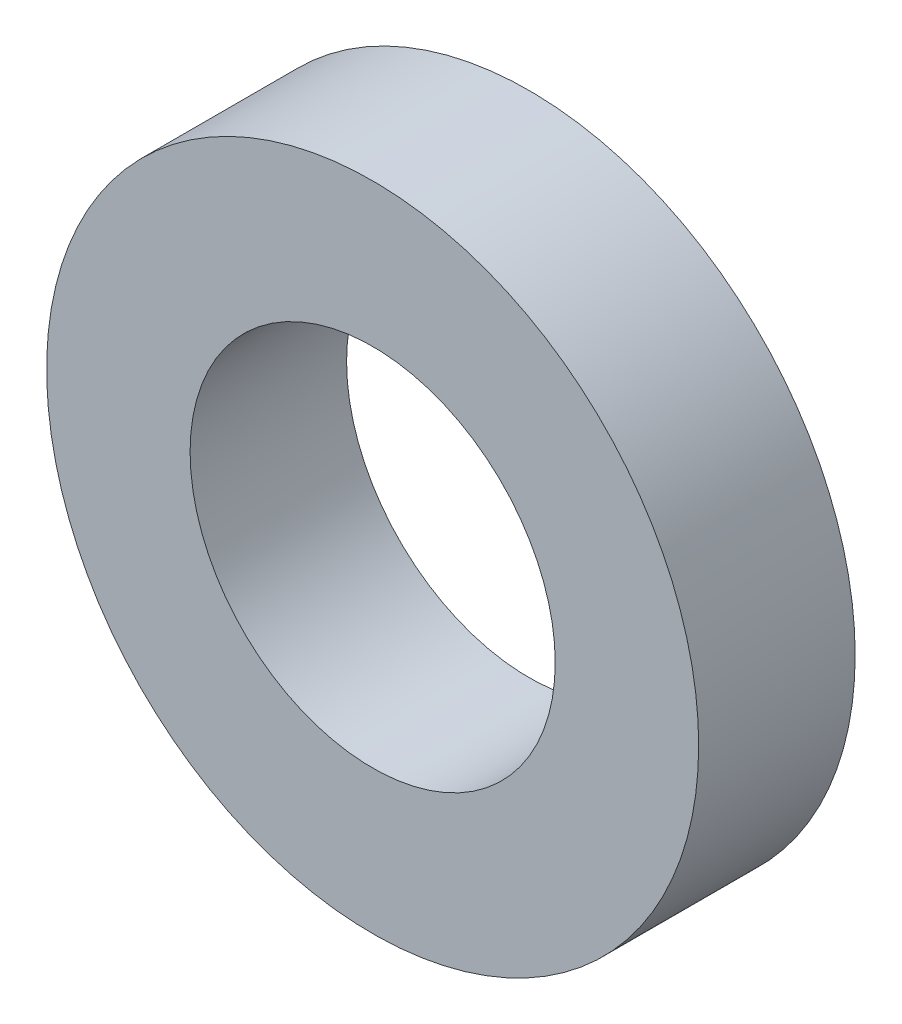
ISO-10303-21;
HEADER;
FILE_DESCRIPTION(('STEP AP214'),'2;1');
FILE_NAME('part.step','',(''),(''),'','','');
FILE_SCHEMA(('AUTOMOTIVE_DESIGN { 1 0 10303 214 1 1 1 1 }'));
ENDSEC;
DATA;
#1=APPLICATION_CONTEXT('core data for automotive mechanical design processes');
#2=APPLICATION_PROTOCOL_DEFINITION('international standard','automotive_design',2000,#1);
#3=PRODUCT_CONTEXT('',#1,'mechanical');
#4=PRODUCT('Part','Part','',(#3));
#5=PRODUCT_RELATED_PRODUCT_CATEGORY('part','',(#4));
#6=PRODUCT_DEFINITION_FORMATION('','',#4);
#7=PRODUCT_DEFINITION_CONTEXT('part definition',#1,'design');
#8=PRODUCT_DEFINITION('design','',#6,#7);
#9=PRODUCT_DEFINITION_SHAPE('','',#8);
#10=(LENGTH_UNIT() NAMED_UNIT(*) SI_UNIT(.MILLI.,.METRE.));
#11=(NAMED_UNIT(*) PLANE_ANGLE_UNIT() SI_UNIT($,.RADIAN.));
#12=(NAMED_UNIT(*) SI_UNIT($,.STERADIAN.) SOLID_ANGLE_UNIT());
#13=UNCERTAINTY_MEASURE_WITH_UNIT(LENGTH_MEASURE(1.E-05),#10,'distance_accuracy_value','');
#14=(GEOMETRIC_REPRESENTATION_CONTEXT(3) GLOBAL_UNCERTAINTY_ASSIGNED_CONTEXT((#13)) GLOBAL_UNIT_ASSIGNED_CONTEXT((#10,
#11,#12)) REPRESENTATION_CONTEXT('',''));
#15=CARTESIAN_POINT('',(0.,0.,0.));
#16=DIRECTION('',(0.,0.,1.));
#17=DIRECTION('',(1.,0.,0.));
#18=AXIS2_PLACEMENT_3D('',#15,#16,#17);
#19=CARTESIAN_POINT('',(0.,0.,6.));
#20=DIRECTION('',(0.,0.,1.));
#21=DIRECTION('',(1.,0.,0.));
#22=AXIS2_PLACEMENT_3D('',#19,#20,#21);
#23=PLANE('',#22);
#24=CARTESIAN_POINT('',(0.,0.,6.));
#25=DIRECTION('',(0.,0.,1.));
#26=DIRECTION('',(1.,0.,0.));
#27=AXIS2_PLACEMENT_3D('',#24,#25,#26);
#28=CIRCLE('',#27,12.5);
#29=CARTESIAN_POINT('',(12.5,0.,6.));
#30=VERTEX_POINT('',#29);
#31=EDGE_CURVE('E10',#30,#30,#28,.T.);
#32=ORIENTED_EDGE('',*,*,#31,.T.);
#33=EDGE_LOOP('',(#32));
#34=FACE_BOUND('',#33,.T.);
#35=CARTESIAN_POINT('',(0.,0.,6.));
#36=DIRECTION('',(0.,0.,1.));
#37=DIRECTION('',(1.,0.,0.));
#38=AXIS2_PLACEMENT_3D('',#35,#36,#37);
#39=CIRCLE('',#38,7.);
#40=CARTESIAN_POINT('',(7.,0.,6.));
#41=VERTEX_POINT('',#40);
#42=EDGE_CURVE('E42',#41,#41,#39,.T.);
#43=ORIENTED_EDGE('',*,*,#42,.F.);
#44=EDGE_LOOP('',(#43));
#45=FACE_BOUND('',#44,.T.);
#46=ADVANCED_FACE('F31',(#34,#45),#23,.T.);
#47=CARTESIAN_POINT('',(0.,0.,0.));
#48=DIRECTION('',(0.,0.,1.));
#49=DIRECTION('',(1.,0.,0.));
#50=AXIS2_PLACEMENT_3D('',#47,#48,#49);
#51=PLANE('',#50);
#52=CARTESIAN_POINT('',(0.,0.,0.));
#53=DIRECTION('',(0.,0.,1.));
#54=DIRECTION('',(1.,0.,0.));
#55=AXIS2_PLACEMENT_3D('',#52,#53,#54);
#56=CIRCLE('',#55,12.5);
#57=CARTESIAN_POINT('',(12.5,0.,0.));
#58=VERTEX_POINT('',#57);
#59=EDGE_CURVE('E35',#58,#58,#56,.T.);
#60=ORIENTED_EDGE('',*,*,#59,.F.);
#61=EDGE_LOOP('',(#60));
#62=FACE_BOUND('',#61,.T.);
#63=CARTESIAN_POINT('',(0.,0.,0.));
#64=DIRECTION('',(0.,0.,1.));
#65=DIRECTION('',(1.,0.,0.));
#66=AXIS2_PLACEMENT_3D('',#63,#64,#65);
#67=CIRCLE('',#66,7.);
#68=CARTESIAN_POINT('',(7.,0.,0.));
#69=VERTEX_POINT('',#68);
#70=EDGE_CURVE('E44',#69,#69,#67,.T.);
#71=ORIENTED_EDGE('',*,*,#70,.T.);
#72=EDGE_LOOP('',(#71));
#73=FACE_BOUND('',#72,.T.);
#74=ADVANCED_FACE('F54',(#62,#73),#51,.F.);
#75=CARTESIAN_POINT('',(0.,0.,6.));
#76=DIRECTION('',(0.,0.,-1.));
#77=DIRECTION('',(-1.,0.,0.));
#78=AXIS2_PLACEMENT_3D('',#75,#76,#77);
#79=CYLINDRICAL_SURFACE('',#78,12.5);
#80=ORIENTED_EDGE('',*,*,#31,.F.);
#81=EDGE_LOOP('',(#80));
#82=FACE_BOUND('',#81,.T.);
#83=ORIENTED_EDGE('',*,*,#59,.T.);
#84=EDGE_LOOP('',(#83));
#85=FACE_BOUND('',#84,.T.);
#86=ADVANCED_FACE('F33',(#82,#85),#79,.T.);
#87=CARTESIAN_POINT('',(0.,0.,6.));
#88=DIRECTION('',(0.,0.,-1.));
#89=DIRECTION('',(-1.,0.,0.));
#90=AXIS2_PLACEMENT_3D('',#87,#88,#89);
#91=CYLINDRICAL_SURFACE('',#90,7.);
#92=ORIENTED_EDGE('',*,*,#42,.T.);
#93=EDGE_LOOP('',(#92));
#94=FACE_BOUND('',#93,.T.);
#95=ORIENTED_EDGE('',*,*,#70,.F.);
#96=EDGE_LOOP('',(#95));
#97=FACE_BOUND('',#96,.T.);
#98=ADVANCED_FACE('F50',(#94,#97),#91,.F.);
#99=CLOSED_SHELL('',(#46,#74,#86,#98));
#100=MANIFOLD_SOLID_BREP('B2',#99);
#101=ADVANCED_BREP_SHAPE_REPRESENTATION('',(#18,#100),#14);
#102=SHAPE_DEFINITION_REPRESENTATION(#9,#101);
ENDSEC;
END-ISO-10303-21;
